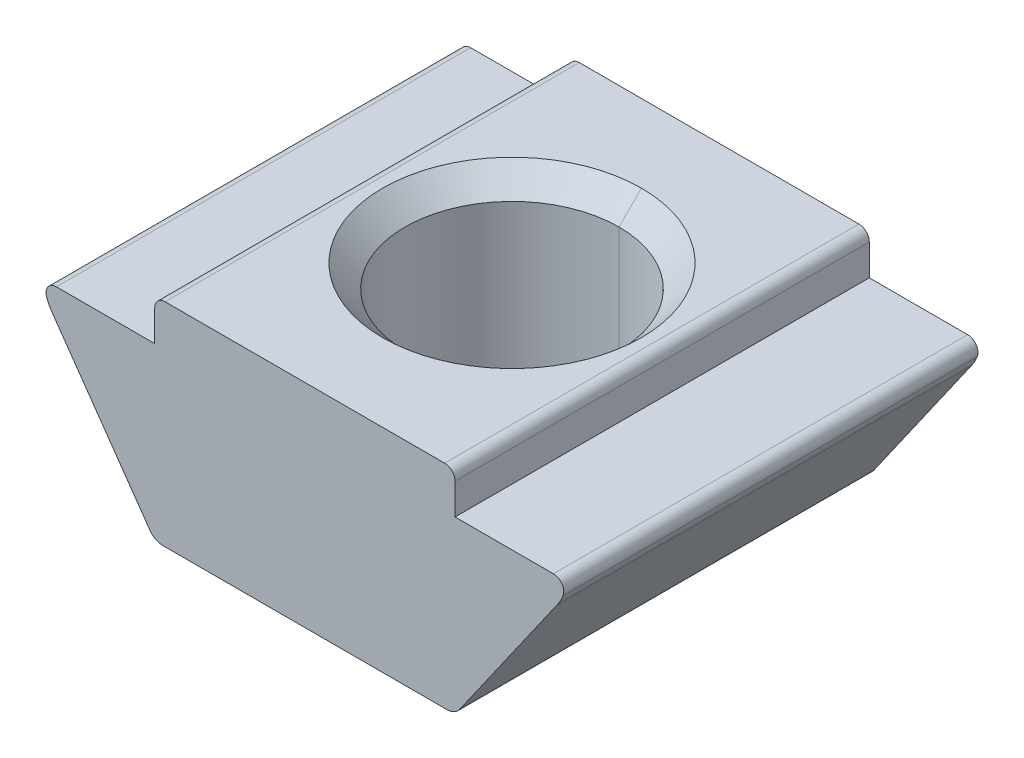
ISO-10303-21;
HEADER;
FILE_DESCRIPTION(('STEP AP214'),'2;1');
FILE_NAME('part.step','',(''),(''),'','','');
FILE_SCHEMA(('AUTOMOTIVE_DESIGN { 1 0 10303 214 1 1 1 1 }'));
ENDSEC;
DATA;
#1=APPLICATION_CONTEXT('core data for automotive mechanical design processes');
#2=APPLICATION_PROTOCOL_DEFINITION('international standard','automotive_design',2000,#1);
#3=PRODUCT_CONTEXT('',#1,'mechanical');
#4=PRODUCT('Part','Part','',(#3));
#5=PRODUCT_RELATED_PRODUCT_CATEGORY('part','',(#4));
#6=PRODUCT_DEFINITION_FORMATION('','',#4);
#7=PRODUCT_DEFINITION_CONTEXT('part definition',#1,'design');
#8=PRODUCT_DEFINITION('design','',#6,#7);
#9=PRODUCT_DEFINITION_SHAPE('','',#8);
#10=(LENGTH_UNIT() NAMED_UNIT(*) SI_UNIT(.MILLI.,.METRE.));
#11=(NAMED_UNIT(*) PLANE_ANGLE_UNIT() SI_UNIT($,.RADIAN.));
#12=(NAMED_UNIT(*) SI_UNIT($,.STERADIAN.) SOLID_ANGLE_UNIT());
#13=UNCERTAINTY_MEASURE_WITH_UNIT(LENGTH_MEASURE(1.E-05),#10,'distance_accuracy_value','');
#14=(GEOMETRIC_REPRESENTATION_CONTEXT(3) GLOBAL_UNCERTAINTY_ASSIGNED_CONTEXT((#13)) GLOBAL_UNIT_ASSIGNED_CONTEXT((#10,
#11,#12)) REPRESENTATION_CONTEXT('',''));
#15=CARTESIAN_POINT('',(0.,0.,0.));
#16=DIRECTION('',(0.,0.,1.));
#17=DIRECTION('',(1.,0.,0.));
#18=AXIS2_PLACEMENT_3D('',#15,#16,#17);
#19=CARTESIAN_POINT('',(-2.9,3.3,8.));
#20=DIRECTION('',(0.,-1.,0.));
#21=DIRECTION('',(0.,0.,-1.));
#22=AXIS2_PLACEMENT_3D('',#19,#20,#21);
#23=PLANE('',#22);
#24=DIRECTION('',(-1.,0.,0.));
#25=VECTOR('',#24,1.);
#26=CARTESIAN_POINT('',(-2.9,3.3,0.));
#27=LINE('',#26,#25);
#28=CARTESIAN_POINT('',(-2.9,3.3,0.));
#29=VERTEX_POINT('',#28);
#30=CARTESIAN_POINT('',(-4.7998662157511,3.3,0.));
#31=VERTEX_POINT('',#30);
#32=EDGE_CURVE('E11',#29,#31,#27,.T.);
#33=ORIENTED_EDGE('',*,*,#32,.T.);
#34=DIRECTION('',(0.,0.,-1.));
#35=VECTOR('',#34,1.);
#36=CARTESIAN_POINT('',(-4.7998662157511,3.3,8.));
#37=LINE('',#36,#35);
#38=CARTESIAN_POINT('',(-4.7998662157511,3.3,8.));
#39=VERTEX_POINT('',#38);
#40=EDGE_CURVE('E25',#39,#31,#37,.T.);
#41=ORIENTED_EDGE('',*,*,#40,.F.);
#42=DIRECTION('',(-1.,0.,0.));
#43=VECTOR('',#42,1.);
#44=CARTESIAN_POINT('',(-2.9,3.3,8.));
#45=LINE('',#44,#43);
#46=CARTESIAN_POINT('',(-2.9,3.3,8.));
#47=VERTEX_POINT('',#46);
#48=EDGE_CURVE('E407',#47,#39,#45,.T.);
#49=ORIENTED_EDGE('',*,*,#48,.F.);
#50=DIRECTION('',(0.,0.,-1.));
#51=VECTOR('',#50,1.);
#52=CARTESIAN_POINT('',(-2.9,3.3,8.));
#53=LINE('',#52,#51);
#54=EDGE_CURVE('E403',#47,#29,#53,.T.);
#55=ORIENTED_EDGE('',*,*,#54,.T.);
#56=EDGE_LOOP('',(#33,#41,#49,#55));
#57=FACE_BOUND('',#56,.T.);
#58=ADVANCED_FACE('F17',(#57),#23,.F.);
#59=CARTESIAN_POINT('',(-2.9,3.9,8.));
#60=DIRECTION('',(1.,0.,0.));
#61=DIRECTION('',(0.,0.,-1.));
#62=AXIS2_PLACEMENT_3D('',#59,#60,#61);
#63=PLANE('',#62);
#64=DIRECTION('',(0.,-1.,0.));
#65=VECTOR('',#64,1.);
#66=CARTESIAN_POINT('',(-2.9,3.9,0.));
#67=LINE('',#66,#65);
#68=CARTESIAN_POINT('',(-2.9,3.9,0.));
#69=VERTEX_POINT('',#68);
#70=EDGE_CURVE('E398',#69,#29,#67,.T.);
#71=ORIENTED_EDGE('',*,*,#70,.T.);
#72=ORIENTED_EDGE('',*,*,#54,.F.);
#73=DIRECTION('',(0.,-1.,0.));
#74=VECTOR('',#73,1.);
#75=CARTESIAN_POINT('',(-2.9,3.9,8.));
#76=LINE('',#75,#74);
#77=CARTESIAN_POINT('',(-2.9,3.9,8.));
#78=VERTEX_POINT('',#77);
#79=EDGE_CURVE('E393',#78,#47,#76,.T.);
#80=ORIENTED_EDGE('',*,*,#79,.F.);
#81=DIRECTION('',(0.,0.,-1.));
#82=VECTOR('',#81,1.);
#83=CARTESIAN_POINT('',(-2.9,3.9,8.));
#84=LINE('',#83,#82);
#85=EDGE_CURVE('E389',#78,#69,#84,.T.);
#86=ORIENTED_EDGE('',*,*,#85,.T.);
#87=EDGE_LOOP('',(#71,#72,#80,#86));
#88=FACE_BOUND('',#87,.T.);
#89=ADVANCED_FACE('F424',(#88),#63,.F.);
#90=CARTESIAN_POINT('',(-2.7,3.9,8.));
#91=DIRECTION('',(0.,0.,-1.));
#92=DIRECTION('',(0.707106781186548,-0.707106781186547,0.));
#93=AXIS2_PLACEMENT_3D('',#90,#91,#92);
#94=CYLINDRICAL_SURFACE('',#93,0.20000000000003);
#95=CARTESIAN_POINT('',(-2.7,3.9,0.));
#96=DIRECTION('',(0.,0.,1.));
#97=DIRECTION('',(1.,0.,0.));
#98=AXIS2_PLACEMENT_3D('',#95,#96,#97);
#99=CIRCLE('',#98,0.20000000000003);
#100=CARTESIAN_POINT('',(-2.7,4.1,0.));
#101=VERTEX_POINT('',#100);
#102=EDGE_CURVE('E384',#101,#69,#99,.T.);
#103=ORIENTED_EDGE('',*,*,#102,.T.);
#104=ORIENTED_EDGE('',*,*,#85,.F.);
#105=CARTESIAN_POINT('',(-2.7,3.9,8.));
#106=DIRECTION('',(0.,0.,1.));
#107=DIRECTION('',(1.,0.,0.));
#108=AXIS2_PLACEMENT_3D('',#105,#106,#107);
#109=CIRCLE('',#108,0.20000000000003);
#110=CARTESIAN_POINT('',(-2.7,4.1,8.));
#111=VERTEX_POINT('',#110);
#112=EDGE_CURVE('E379',#111,#78,#109,.T.);
#113=ORIENTED_EDGE('',*,*,#112,.F.);
#114=DIRECTION('',(0.,0.,-1.));
#115=VECTOR('',#114,1.);
#116=CARTESIAN_POINT('',(-2.7,4.1,8.));
#117=LINE('',#116,#115);
#118=EDGE_CURVE('E375',#111,#101,#117,.T.);
#119=ORIENTED_EDGE('',*,*,#118,.T.);
#120=EDGE_LOOP('',(#103,#104,#113,#119));
#121=FACE_BOUND('',#120,.T.);
#122=ADVANCED_FACE('F478',(#121),#94,.T.);
#123=CARTESIAN_POINT('',(2.7,4.1,8.));
#124=DIRECTION('',(0.,-1.,0.));
#125=DIRECTION('',(0.,0.,-1.));
#126=AXIS2_PLACEMENT_3D('',#123,#124,#125);
#127=PLANE('',#126);
#128=CARTESIAN_POINT('',(0.,4.1,4.));
#129=DIRECTION('',(0.,1.,0.));
#130=DIRECTION('',(0.,0.,1.));
#131=AXIS2_PLACEMENT_3D('',#128,#129,#130);
#132=CIRCLE('',#131,2.5);
#133=CARTESIAN_POINT('',(0.,4.1,1.5));
#134=VERTEX_POINT('',#133);
#135=CARTESIAN_POINT('',(0.,4.1,6.5));
#136=VERTEX_POINT('',#135);
#137=EDGE_CURVE('E161',#134,#136,#132,.T.);
#138=ORIENTED_EDGE('',*,*,#137,.F.);
#139=CARTESIAN_POINT('',(0.,4.1,4.));
#140=DIRECTION('',(0.,1.,0.));
#141=DIRECTION('',(0.,0.,1.));
#142=AXIS2_PLACEMENT_3D('',#139,#140,#141);
#143=CIRCLE('',#142,2.5);
#144=EDGE_CURVE('E368',#136,#134,#143,.T.);
#145=ORIENTED_EDGE('',*,*,#144,.F.);
#146=EDGE_LOOP('',(#138,#145));
#147=FACE_BOUND('',#146,.T.);
#148=DIRECTION('',(-1.,0.,0.));
#149=VECTOR('',#148,1.);
#150=CARTESIAN_POINT('',(2.7,4.1,0.));
#151=LINE('',#150,#149);
#152=CARTESIAN_POINT('',(2.7,4.1,0.));
#153=VERTEX_POINT('',#152);
#154=EDGE_CURVE('E363',#153,#101,#151,.T.);
#155=ORIENTED_EDGE('',*,*,#154,.T.);
#156=ORIENTED_EDGE('',*,*,#118,.F.);
#157=DIRECTION('',(-1.,0.,0.));
#158=VECTOR('',#157,1.);
#159=CARTESIAN_POINT('',(2.7,4.1,8.));
#160=LINE('',#159,#158);
#161=CARTESIAN_POINT('',(2.7,4.1,8.));
#162=VERTEX_POINT('',#161);
#163=EDGE_CURVE('E358',#162,#111,#160,.T.);
#164=ORIENTED_EDGE('',*,*,#163,.F.);
#165=DIRECTION('',(0.,0.,-1.));
#166=VECTOR('',#165,1.);
#167=CARTESIAN_POINT('',(2.7,4.1,8.));
#168=LINE('',#167,#166);
#169=EDGE_CURVE('E354',#162,#153,#168,.T.);
#170=ORIENTED_EDGE('',*,*,#169,.T.);
#171=EDGE_LOOP('',(#155,#156,#164,#170));
#172=FACE_BOUND('',#171,.T.);
#173=ADVANCED_FACE('F475',(#147,#172),#127,.F.);
#174=CARTESIAN_POINT('',(2.7,3.9,8.));
#175=DIRECTION('',(0.,0.,-1.));
#176=DIRECTION('',(-0.707106781186548,-0.707106781186547,0.));
#177=AXIS2_PLACEMENT_3D('',#174,#175,#176);
#178=CYLINDRICAL_SURFACE('',#177,0.200000000000031);
#179=CARTESIAN_POINT('',(2.7,3.9,0.));
#180=DIRECTION('',(0.,0.,1.));
#181=DIRECTION('',(1.,0.,0.));
#182=AXIS2_PLACEMENT_3D('',#179,#180,#181);
#183=CIRCLE('',#182,0.200000000000031);
#184=CARTESIAN_POINT('',(2.9,3.9,0.));
#185=VERTEX_POINT('',#184);
#186=EDGE_CURVE('E349',#185,#153,#183,.T.);
#187=ORIENTED_EDGE('',*,*,#186,.T.);
#188=ORIENTED_EDGE('',*,*,#169,.F.);
#189=CARTESIAN_POINT('',(2.7,3.9,8.));
#190=DIRECTION('',(0.,0.,1.));
#191=DIRECTION('',(1.,0.,0.));
#192=AXIS2_PLACEMENT_3D('',#189,#190,#191);
#193=CIRCLE('',#192,0.200000000000031);
#194=CARTESIAN_POINT('',(2.9,3.9,8.));
#195=VERTEX_POINT('',#194);
#196=EDGE_CURVE('E344',#195,#162,#193,.T.);
#197=ORIENTED_EDGE('',*,*,#196,.F.);
#198=DIRECTION('',(0.,0.,-1.));
#199=VECTOR('',#198,1.);
#200=CARTESIAN_POINT('',(2.9,3.9,8.));
#201=LINE('',#200,#199);
#202=EDGE_CURVE('E340',#195,#185,#201,.T.);
#203=ORIENTED_EDGE('',*,*,#202,.T.);
#204=EDGE_LOOP('',(#187,#188,#197,#203));
#205=FACE_BOUND('',#204,.T.);
#206=ADVANCED_FACE('F472',(#205),#178,.T.);
#207=CARTESIAN_POINT('',(2.9,3.3,8.));
#208=DIRECTION('',(-1.,0.,0.));
#209=DIRECTION('',(0.,0.,1.));
#210=AXIS2_PLACEMENT_3D('',#207,#208,#209);
#211=PLANE('',#210);
#212=DIRECTION('',(0.,1.,0.));
#213=VECTOR('',#212,1.);
#214=CARTESIAN_POINT('',(2.9,3.3,0.));
#215=LINE('',#214,#213);
#216=CARTESIAN_POINT('',(2.9,3.3,0.));
#217=VERTEX_POINT('',#216);
#218=EDGE_CURVE('E335',#217,#185,#215,.T.);
#219=ORIENTED_EDGE('',*,*,#218,.T.);
#220=ORIENTED_EDGE('',*,*,#202,.F.);
#221=DIRECTION('',(0.,1.,0.));
#222=VECTOR('',#221,1.);
#223=CARTESIAN_POINT('',(2.9,3.3,8.));
#224=LINE('',#223,#222);
#225=CARTESIAN_POINT('',(2.9,3.3,8.));
#226=VERTEX_POINT('',#225);
#227=EDGE_CURVE('E330',#226,#195,#224,.T.);
#228=ORIENTED_EDGE('',*,*,#227,.F.);
#229=DIRECTION('',(0.,0.,-1.));
#230=VECTOR('',#229,1.);
#231=CARTESIAN_POINT('',(2.9,3.3,8.));
#232=LINE('',#231,#230);
#233=EDGE_CURVE('E326',#226,#217,#232,.T.);
#234=ORIENTED_EDGE('',*,*,#233,.T.);
#235=EDGE_LOOP('',(#219,#220,#228,#234));
#236=FACE_BOUND('',#235,.T.);
#237=ADVANCED_FACE('F467',(#236),#211,.F.);
#238=CARTESIAN_POINT('',(4.7998662157511,3.3,8.));
#239=DIRECTION('',(0.,-1.,0.));
#240=DIRECTION('',(0.,0.,-1.));
#241=AXIS2_PLACEMENT_3D('',#238,#239,#240);
#242=PLANE('',#241);
#243=DIRECTION('',(-1.,0.,0.));
#244=VECTOR('',#243,1.);
#245=CARTESIAN_POINT('',(4.7998662157511,3.3,0.));
#246=LINE('',#245,#244);
#247=CARTESIAN_POINT('',(4.7998662157511,3.3,0.));
#248=VERTEX_POINT('',#247);
#249=EDGE_CURVE('E321',#248,#217,#246,.T.);
#250=ORIENTED_EDGE('',*,*,#249,.T.);
#251=ORIENTED_EDGE('',*,*,#233,.F.);
#252=DIRECTION('',(-1.,0.,0.));
#253=VECTOR('',#252,1.);
#254=CARTESIAN_POINT('',(4.7998662157511,3.3,8.));
#255=LINE('',#254,#253);
#256=CARTESIAN_POINT('',(4.7998662157511,3.3,8.));
#257=VERTEX_POINT('',#256);
#258=EDGE_CURVE('E316',#257,#226,#255,.T.);
#259=ORIENTED_EDGE('',*,*,#258,.F.);
#260=DIRECTION('',(0.,0.,-1.));
#261=VECTOR('',#260,1.);
#262=CARTESIAN_POINT('',(4.7998662157511,3.3,8.));
#263=LINE('',#262,#261);
#264=EDGE_CURVE('E312',#257,#248,#263,.T.);
#265=ORIENTED_EDGE('',*,*,#264,.T.);
#266=EDGE_LOOP('',(#250,#251,#259,#265));
#267=FACE_BOUND('',#266,.T.);
#268=ADVANCED_FACE('F463',(#267),#242,.F.);
#269=CARTESIAN_POINT('',(4.7998662157511,3.10000000000006,8.));
#270=DIRECTION('',(0.,0.,-1.));
#271=DIRECTION('',(-0.827037597866269,-0.562146610516858,0.));
#272=AXIS2_PLACEMENT_3D('',#269,#270,#271);
#273=CYLINDRICAL_SURFACE('',#272,0.199999999999944);
#274=CARTESIAN_POINT('',(4.7998662157511,3.10000000000006,0.));
#275=DIRECTION('',(0.,0.,1.));
#276=DIRECTION('',(1.,0.,0.));
#277=AXIS2_PLACEMENT_3D('',#274,#275,#276);
#278=CIRCLE('',#277,0.199999999999944);
#279=CARTESIAN_POINT('',(4.9858327696888,3.0264035271463,0.));
#280=VERTEX_POINT('',#279);
#281=EDGE_CURVE('E307',#280,#248,#278,.T.);
#282=ORIENTED_EDGE('',*,*,#281,.T.);
#283=ORIENTED_EDGE('',*,*,#264,.F.);
#284=CARTESIAN_POINT('',(4.7998662157511,3.10000000000006,8.));
#285=DIRECTION('',(0.,0.,1.));
#286=DIRECTION('',(1.,0.,0.));
#287=AXIS2_PLACEMENT_3D('',#284,#285,#286);
#288=CIRCLE('',#287,0.199999999999944);
#289=CARTESIAN_POINT('',(4.9858327696888,3.0264035271463,8.));
#290=VERTEX_POINT('',#289);
#291=EDGE_CURVE('E302',#290,#257,#288,.T.);
#292=ORIENTED_EDGE('',*,*,#291,.F.);
#293=DIRECTION('',(0.,0.,-1.));
#294=VECTOR('',#293,1.);
#295=CARTESIAN_POINT('',(4.9858327696888,3.0264035271463,8.));
#296=LINE('',#295,#294);
#297=EDGE_CURVE('E298',#290,#280,#296,.T.);
#298=ORIENTED_EDGE('',*,*,#297,.T.);
#299=EDGE_LOOP('',(#282,#283,#292,#298));
#300=FACE_BOUND('',#299,.T.);
#301=ADVANCED_FACE('F460',(#300),#273,.T.);
#302=CARTESIAN_POINT('',(4.05600000000028,3.39438589141449,8.));
#303=DIRECTION('',(0.,0.,-1.));
#304=DIRECTION('',(-0.880513596901839,0.474020891597602,0.));
#305=AXIS2_PLACEMENT_3D('',#302,#303,#304);
#306=CYLINDRICAL_SURFACE('',#305,0.999999999999519);
#307=CARTESIAN_POINT('',(4.05600000000028,3.39438589141449,0.));
#308=DIRECTION('',(0.,0.,1.));
#309=DIRECTION('',(1.,0.,0.));
#310=AXIS2_PLACEMENT_3D('',#307,#308,#309);
#311=CIRCLE('',#310,0.999999999999519);
#312=CARTESIAN_POINT('',(4.875152044289,2.8208094550639,0.));
#313=VERTEX_POINT('',#312);
#314=EDGE_CURVE('E293',#313,#280,#311,.T.);
#315=ORIENTED_EDGE('',*,*,#314,.T.);
#316=ORIENTED_EDGE('',*,*,#297,.F.);
#317=CARTESIAN_POINT('',(4.05600000000028,3.39438589141449,8.));
#318=DIRECTION('',(0.,0.,1.));
#319=DIRECTION('',(1.,0.,0.));
#320=AXIS2_PLACEMENT_3D('',#317,#318,#319);
#321=CIRCLE('',#320,0.999999999999519);
#322=CARTESIAN_POINT('',(4.875152044289,2.8208094550639,8.));
#323=VERTEX_POINT('',#322);
#324=EDGE_CURVE('E288',#323,#290,#321,.T.);
#325=ORIENTED_EDGE('',*,*,#324,.F.);
#326=DIRECTION('',(0.,0.,-1.));
#327=VECTOR('',#326,1.);
#328=CARTESIAN_POINT('',(4.875152044289,2.8208094550639,8.));
#329=LINE('',#328,#327);
#330=EDGE_CURVE('E284',#323,#313,#329,.T.);
#331=ORIENTED_EDGE('',*,*,#330,.T.);
#332=EDGE_LOOP('',(#315,#316,#325,#331));
#333=FACE_BOUND('',#332,.T.);
#334=ADVANCED_FACE('F455',(#333),#306,.T.);
#335=CARTESIAN_POINT('',(2.9895754981212,0.12792706909469,8.));
#336=DIRECTION('',(-0.819152044288991,0.573576436351048,0.));
#337=DIRECTION('',(-0.573576436351048,-0.819152044288991,0.));
#338=AXIS2_PLACEMENT_3D('',#335,#336,#337);
#339=PLANE('',#338);
#340=DIRECTION('',(0.573576436351048,0.81915204428899,0.));
#341=VECTOR('',#340,1.);
#342=CARTESIAN_POINT('',(2.9895754981212,0.12792706909469,0.));
#343=LINE('',#342,#341);
#344=CARTESIAN_POINT('',(2.9895754981212,0.12792706909469,0.));
#345=VERTEX_POINT('',#344);
#346=EDGE_CURVE('E279',#345,#313,#343,.T.);
#347=ORIENTED_EDGE('',*,*,#346,.T.);
#348=ORIENTED_EDGE('',*,*,#330,.F.);
#349=DIRECTION('',(0.573576436351048,0.81915204428899,0.));
#350=VECTOR('',#349,1.);
#351=CARTESIAN_POINT('',(2.9895754981212,0.12792706909469,8.));
#352=LINE('',#351,#350);
#353=CARTESIAN_POINT('',(2.9895754981212,0.12792706909469,8.));
#354=VERTEX_POINT('',#353);
#355=EDGE_CURVE('E274',#354,#323,#352,.T.);
#356=ORIENTED_EDGE('',*,*,#355,.F.);
#357=DIRECTION('',(0.,0.,-1.));
#358=VECTOR('',#357,1.);
#359=CARTESIAN_POINT('',(2.9895754981212,0.12792706909469,8.));
#360=LINE('',#359,#358);
#361=EDGE_CURVE('E270',#354,#345,#360,.T.);
#362=ORIENTED_EDGE('',*,*,#361,.T.);
#363=EDGE_LOOP('',(#347,#348,#356,#362));
#364=FACE_BOUND('',#363,.T.);
#365=ADVANCED_FACE('F452',(#364),#339,.F.);
#366=CARTESIAN_POINT('',(2.74382988483448,0.300000000000038,8.));
#367=DIRECTION('',(0.,0.,-1.));
#368=DIRECTION('',(-0.461748613235041,0.887010833178218,0.));
#369=AXIS2_PLACEMENT_3D('',#366,#367,#368);
#370=CYLINDRICAL_SURFACE('',#369,0.300000000000038);
#371=CARTESIAN_POINT('',(2.74382988483448,0.300000000000038,0.));
#372=DIRECTION('',(0.,0.,1.));
#373=DIRECTION('',(1.,0.,0.));
#374=AXIS2_PLACEMENT_3D('',#371,#372,#373);
#375=CIRCLE('',#374,0.300000000000038);
#376=CARTESIAN_POINT('',(2.7438298848345,0.,0.));
#377=VERTEX_POINT('',#376);
#378=EDGE_CURVE('E265',#377,#345,#375,.T.);
#379=ORIENTED_EDGE('',*,*,#378,.T.);
#380=ORIENTED_EDGE('',*,*,#361,.F.);
#381=CARTESIAN_POINT('',(2.74382988483448,0.300000000000038,8.));
#382=DIRECTION('',(0.,0.,1.));
#383=DIRECTION('',(1.,0.,0.));
#384=AXIS2_PLACEMENT_3D('',#381,#382,#383);
#385=CIRCLE('',#384,0.300000000000038);
#386=CARTESIAN_POINT('',(2.7438298848345,0.,8.));
#387=VERTEX_POINT('',#386);
#388=EDGE_CURVE('E260',#387,#354,#385,.T.);
#389=ORIENTED_EDGE('',*,*,#388,.F.);
#390=DIRECTION('',(0.,0.,-1.));
#391=VECTOR('',#390,1.);
#392=CARTESIAN_POINT('',(2.7438298848345,0.,8.));
#393=LINE('',#392,#391);
#394=EDGE_CURVE('E256',#387,#377,#393,.T.);
#395=ORIENTED_EDGE('',*,*,#394,.T.);
#396=EDGE_LOOP('',(#379,#380,#389,#395));
#397=FACE_BOUND('',#396,.T.);
#398=ADVANCED_FACE('F449',(#397),#370,.T.);
#399=CARTESIAN_POINT('',(-2.7438298848345,0.,8.));
#400=DIRECTION('',(0.,1.,0.));
#401=DIRECTION('',(0.,0.,1.));
#402=AXIS2_PLACEMENT_3D('',#399,#400,#401);
#403=PLANE('',#402);
#404=CARTESIAN_POINT('',(0.,0.,4.));
#405=DIRECTION('',(0.,1.,0.));
#406=DIRECTION('',(0.,0.,1.));
#407=AXIS2_PLACEMENT_3D('',#404,#405,#406);
#408=CIRCLE('',#407,2.067);
#409=CARTESIAN_POINT('',(0.,0.,6.067));
#410=VERTEX_POINT('',#409);
#411=CARTESIAN_POINT('',(0.,0.,1.933));
#412=VERTEX_POINT('',#411);
#413=EDGE_CURVE('E173',#410,#412,#408,.T.);
#414=ORIENTED_EDGE('',*,*,#413,.T.);
#415=CARTESIAN_POINT('',(0.,0.,4.));
#416=DIRECTION('',(0.,1.,0.));
#417=DIRECTION('',(0.,0.,1.));
#418=AXIS2_PLACEMENT_3D('',#415,#416,#417);
#419=CIRCLE('',#418,2.067);
#420=EDGE_CURVE('E249',#412,#410,#419,.T.);
#421=ORIENTED_EDGE('',*,*,#420,.T.);
#422=EDGE_LOOP('',(#414,#421));
#423=FACE_BOUND('',#422,.T.);
#424=DIRECTION('',(1.,0.,0.));
#425=VECTOR('',#424,1.);
#426=CARTESIAN_POINT('',(-2.7438298848345,0.,0.));
#427=LINE('',#426,#425);
#428=CARTESIAN_POINT('',(-2.7438298848345,0.,0.));
#429=VERTEX_POINT('',#428);
#430=EDGE_CURVE('E244',#429,#377,#427,.T.);
#431=ORIENTED_EDGE('',*,*,#430,.T.);
#432=ORIENTED_EDGE('',*,*,#394,.F.);
#433=DIRECTION('',(1.,0.,0.));
#434=VECTOR('',#433,1.);
#435=CARTESIAN_POINT('',(-2.7438298848345,0.,8.));
#436=LINE('',#435,#434);
#437=CARTESIAN_POINT('',(-2.7438298848345,0.,8.));
#438=VERTEX_POINT('',#437);
#439=EDGE_CURVE('E239',#438,#387,#436,.T.);
#440=ORIENTED_EDGE('',*,*,#439,.F.);
#441=DIRECTION('',(0.,0.,-1.));
#442=VECTOR('',#441,1.);
#443=CARTESIAN_POINT('',(-2.7438298848345,0.,8.));
#444=LINE('',#443,#442);
#445=EDGE_CURVE('E235',#438,#429,#444,.T.);
#446=ORIENTED_EDGE('',*,*,#445,.T.);
#447=EDGE_LOOP('',(#431,#432,#440,#446));
#448=FACE_BOUND('',#447,.T.);
#449=ADVANCED_FACE('F443',(#423,#448),#403,.F.);
#450=CARTESIAN_POINT('',(-2.74382988483449,0.300000000000032,8.));
#451=DIRECTION('',(0.,0.,-1.));
#452=DIRECTION('',(0.461748613235037,0.88701083317822,0.));
#453=AXIS2_PLACEMENT_3D('',#450,#451,#452);
#454=CYLINDRICAL_SURFACE('',#453,0.300000000000032);
#455=CARTESIAN_POINT('',(-2.74382988483449,0.300000000000032,0.));
#456=DIRECTION('',(0.,0.,1.));
#457=DIRECTION('',(1.,0.,0.));
#458=AXIS2_PLACEMENT_3D('',#455,#456,#457);
#459=CIRCLE('',#458,0.300000000000032);
#460=CARTESIAN_POINT('',(-2.9895754981212,0.12792706909469,0.));
#461=VERTEX_POINT('',#460);
#462=EDGE_CURVE('E230',#461,#429,#459,.T.);
#463=ORIENTED_EDGE('',*,*,#462,.T.);
#464=ORIENTED_EDGE('',*,*,#445,.F.);
#465=CARTESIAN_POINT('',(-2.74382988483449,0.300000000000032,8.));
#466=DIRECTION('',(0.,0.,1.));
#467=DIRECTION('',(1.,0.,0.));
#468=AXIS2_PLACEMENT_3D('',#465,#466,#467);
#469=CIRCLE('',#468,0.300000000000032);
#470=CARTESIAN_POINT('',(-2.9895754981212,0.12792706909469,8.));
#471=VERTEX_POINT('',#470);
#472=EDGE_CURVE('E225',#471,#438,#469,.T.);
#473=ORIENTED_EDGE('',*,*,#472,.F.);
#474=DIRECTION('',(0.,0.,-1.));
#475=VECTOR('',#474,1.);
#476=CARTESIAN_POINT('',(-2.9895754981212,0.12792706909469,8.));
#477=LINE('',#476,#475);
#478=EDGE_CURVE('E221',#471,#461,#477,.T.);
#479=ORIENTED_EDGE('',*,*,#478,.T.);
#480=EDGE_LOOP('',(#463,#464,#473,#479));
#481=FACE_BOUND('',#480,.T.);
#482=ADVANCED_FACE('F440',(#481),#454,.T.);
#483=CARTESIAN_POINT('',(-4.875152044289,2.8208094550639,8.));
#484=DIRECTION('',(0.819152044288991,0.573576436351048,0.));
#485=DIRECTION('',(-0.573576436351048,0.819152044288991,0.));
#486=AXIS2_PLACEMENT_3D('',#483,#484,#485);
#487=PLANE('',#486);
#488=DIRECTION('',(0.573576436351048,-0.81915204428899,0.));
#489=VECTOR('',#488,1.);
#490=CARTESIAN_POINT('',(-4.875152044289,2.8208094550639,0.));
#491=LINE('',#490,#489);
#492=CARTESIAN_POINT('',(-4.875152044289,2.8208094550639,0.));
#493=VERTEX_POINT('',#492);
#494=EDGE_CURVE('E216',#493,#461,#491,.T.);
#495=ORIENTED_EDGE('',*,*,#494,.T.);
#496=ORIENTED_EDGE('',*,*,#478,.F.);
#497=DIRECTION('',(0.573576436351048,-0.81915204428899,0.));
#498=VECTOR('',#497,1.);
#499=CARTESIAN_POINT('',(-4.875152044289,2.8208094550639,8.));
#500=LINE('',#499,#498);
#501=CARTESIAN_POINT('',(-4.875152044289,2.8208094550639,8.));
#502=VERTEX_POINT('',#501);
#503=EDGE_CURVE('E211',#502,#471,#500,.T.);
#504=ORIENTED_EDGE('',*,*,#503,.F.);
#505=DIRECTION('',(0.,0.,-1.));
#506=VECTOR('',#505,1.);
#507=CARTESIAN_POINT('',(-4.875152044289,2.8208094550639,8.));
#508=LINE('',#507,#506);
#509=EDGE_CURVE('E207',#502,#493,#508,.T.);
#510=ORIENTED_EDGE('',*,*,#509,.T.);
#511=EDGE_LOOP('',(#495,#496,#504,#510));
#512=FACE_BOUND('',#511,.T.);
#513=ADVANCED_FACE('F438',(#512),#487,.F.);
#514=CARTESIAN_POINT('',(-4.05600000000028,3.39438589141449,8.));
#515=DIRECTION('',(0.,0.,-1.));
#516=DIRECTION('',(0.880513596901123,0.474020891598932,0.));
#517=AXIS2_PLACEMENT_3D('',#514,#515,#516);
#518=CYLINDRICAL_SURFACE('',#517,0.999999999999519);
#519=CARTESIAN_POINT('',(-4.05600000000028,3.39438589141449,0.));
#520=DIRECTION('',(0.,0.,1.));
#521=DIRECTION('',(1.,0.,0.));
#522=AXIS2_PLACEMENT_3D('',#519,#520,#521);
#523=CIRCLE('',#522,0.999999999999519);
#524=CARTESIAN_POINT('',(-4.9858327696888,3.0264035271463,0.));
#525=VERTEX_POINT('',#524);
#526=EDGE_CURVE('E202',#525,#493,#523,.T.);
#527=ORIENTED_EDGE('',*,*,#526,.T.);
#528=ORIENTED_EDGE('',*,*,#509,.F.);
#529=CARTESIAN_POINT('',(-4.05600000000028,3.39438589141449,8.));
#530=DIRECTION('',(0.,0.,1.));
#531=DIRECTION('',(1.,0.,0.));
#532=AXIS2_PLACEMENT_3D('',#529,#530,#531);
#533=CIRCLE('',#532,0.999999999999519);
#534=CARTESIAN_POINT('',(-4.9858327696888,3.0264035271463,8.));
#535=VERTEX_POINT('',#534);
#536=EDGE_CURVE('E197',#535,#502,#533,.T.);
#537=ORIENTED_EDGE('',*,*,#536,.F.);
#538=DIRECTION('',(0.,0.,-1.));
#539=VECTOR('',#538,1.);
#540=CARTESIAN_POINT('',(-4.9858327696888,3.0264035271463,8.));
#541=LINE('',#540,#539);
#542=EDGE_CURVE('E193',#535,#525,#541,.T.);
#543=ORIENTED_EDGE('',*,*,#542,.T.);
#544=EDGE_LOOP('',(#527,#528,#537,#543));
#545=FACE_BOUND('',#544,.T.);
#546=ADVANCED_FACE('F434',(#545),#518,.T.);
#547=CARTESIAN_POINT('',(-4.7998662157511,3.10000000000006,8.));
#548=DIRECTION('',(0.,0.,-1.));
#549=DIRECTION('',(0.82703759786627,-0.562146610516857,0.));
#550=AXIS2_PLACEMENT_3D('',#547,#548,#549);
#551=CYLINDRICAL_SURFACE('',#550,0.199999999999944);
#552=CARTESIAN_POINT('',(-4.7998662157511,3.10000000000006,0.));
#553=DIRECTION('',(0.,0.,1.));
#554=DIRECTION('',(1.,0.,0.));
#555=AXIS2_PLACEMENT_3D('',#552,#553,#554);
#556=CIRCLE('',#555,0.199999999999944);
#557=EDGE_CURVE('E188',#31,#525,#556,.T.);
#558=ORIENTED_EDGE('',*,*,#557,.T.);
#559=ORIENTED_EDGE('',*,*,#542,.F.);
#560=CARTESIAN_POINT('',(-4.7998662157511,3.10000000000006,8.));
#561=DIRECTION('',(0.,0.,1.));
#562=DIRECTION('',(1.,0.,0.));
#563=AXIS2_PLACEMENT_3D('',#560,#561,#562);
#564=CIRCLE('',#563,0.199999999999944);
#565=EDGE_CURVE('E183',#39,#535,#564,.T.);
#566=ORIENTED_EDGE('',*,*,#565,.F.);
#567=ORIENTED_EDGE('',*,*,#40,.T.);
#568=EDGE_LOOP('',(#558,#559,#566,#567));
#569=FACE_BOUND('',#568,.T.);
#570=ADVANCED_FACE('F417',(#569),#551,.T.);
#571=CARTESIAN_POINT('',(-4.7998662157511,3.10000000000006,8.));
#572=DIRECTION('',(0.,0.,1.));
#573=DIRECTION('',(1.,0.,0.));
#574=AXIS2_PLACEMENT_3D('',#571,#572,#573);
#575=PLANE('',#574);
#576=ORIENTED_EDGE('',*,*,#48,.T.);
#577=ORIENTED_EDGE('',*,*,#565,.T.);
#578=ORIENTED_EDGE('',*,*,#536,.T.);
#579=ORIENTED_EDGE('',*,*,#503,.T.);
#580=ORIENTED_EDGE('',*,*,#472,.T.);
#581=ORIENTED_EDGE('',*,*,#439,.T.);
#582=ORIENTED_EDGE('',*,*,#388,.T.);
#583=ORIENTED_EDGE('',*,*,#355,.T.);
#584=ORIENTED_EDGE('',*,*,#324,.T.);
#585=ORIENTED_EDGE('',*,*,#291,.T.);
#586=ORIENTED_EDGE('',*,*,#258,.T.);
#587=ORIENTED_EDGE('',*,*,#227,.T.);
#588=ORIENTED_EDGE('',*,*,#196,.T.);
#589=ORIENTED_EDGE('',*,*,#163,.T.);
#590=ORIENTED_EDGE('',*,*,#112,.T.);
#591=ORIENTED_EDGE('',*,*,#79,.T.);
#592=EDGE_LOOP('',(#576,#577,#578,#579,#580,#581,#582,#583,#584,#585,#586,#587,#588,#589,#590,#591));
#593=FACE_BOUND('',#592,.T.);
#594=ADVANCED_FACE('F421',(#593),#575,.T.);
#595=CARTESIAN_POINT('',(-4.7998662157511,3.10000000000006,0.));
#596=DIRECTION('',(0.,0.,1.));
#597=DIRECTION('',(1.,0.,0.));
#598=AXIS2_PLACEMENT_3D('',#595,#596,#597);
#599=PLANE('',#598);
#600=ORIENTED_EDGE('',*,*,#32,.F.);
#601=ORIENTED_EDGE('',*,*,#70,.F.);
#602=ORIENTED_EDGE('',*,*,#102,.F.);
#603=ORIENTED_EDGE('',*,*,#154,.F.);
#604=ORIENTED_EDGE('',*,*,#186,.F.);
#605=ORIENTED_EDGE('',*,*,#218,.F.);
#606=ORIENTED_EDGE('',*,*,#249,.F.);
#607=ORIENTED_EDGE('',*,*,#281,.F.);
#608=ORIENTED_EDGE('',*,*,#314,.F.);
#609=ORIENTED_EDGE('',*,*,#346,.F.);
#610=ORIENTED_EDGE('',*,*,#378,.F.);
#611=ORIENTED_EDGE('',*,*,#430,.F.);
#612=ORIENTED_EDGE('',*,*,#462,.F.);
#613=ORIENTED_EDGE('',*,*,#494,.F.);
#614=ORIENTED_EDGE('',*,*,#526,.F.);
#615=ORIENTED_EDGE('',*,*,#557,.F.);
#616=EDGE_LOOP('',(#600,#601,#602,#603,#604,#605,#606,#607,#608,#609,#610,#611,#612,#613,#614,#615));
#617=FACE_BOUND('',#616,.T.);
#618=ADVANCED_FACE('F429',(#617),#599,.F.);
#619=CARTESIAN_POINT('',(0.,4.1,4.));
#620=DIRECTION('',(0.,1.,0.));
#621=DIRECTION('',(1.,0.,0.));
#622=AXIS2_PLACEMENT_3D('',#619,#620,#621);
#623=CYLINDRICAL_SURFACE('',#622,2.067);
#624=DIRECTION('',(0.,1.,0.));
#625=VECTOR('',#624,1.);
#626=CARTESIAN_POINT('',(0.,0.,1.933));
#627=LINE('',#626,#625);
#628=CARTESIAN_POINT('',(0.,3.667,1.933));
#629=VERTEX_POINT('',#628);
#630=EDGE_CURVE('E151',#412,#629,#627,.T.);
#631=ORIENTED_EDGE('',*,*,#630,.T.);
#632=CARTESIAN_POINT('',(0.,3.667,4.));
#633=DIRECTION('',(0.,1.,0.));
#634=DIRECTION('',(0.,0.,1.));
#635=AXIS2_PLACEMENT_3D('',#632,#633,#634);
#636=CIRCLE('',#635,2.067);
#637=CARTESIAN_POINT('',(0.,3.667,6.067));
#638=VERTEX_POINT('',#637);
#639=EDGE_CURVE('E144',#629,#638,#636,.T.);
#640=ORIENTED_EDGE('',*,*,#639,.T.);
#641=DIRECTION('',(0.,1.,0.));
#642=VECTOR('',#641,1.);
#643=CARTESIAN_POINT('',(0.,0.,6.067));
#644=LINE('',#643,#642);
#645=EDGE_CURVE('E149',#410,#638,#644,.T.);
#646=ORIENTED_EDGE('',*,*,#645,.F.);
#647=ORIENTED_EDGE('',*,*,#420,.F.);
#648=EDGE_LOOP('',(#631,#640,#646,#647));
#649=FACE_BOUND('',#648,.T.);
#650=ADVANCED_FACE('F146',(#649),#623,.F.);
#651=CARTESIAN_POINT('',(0.,4.1,4.));
#652=DIRECTION('',(0.,1.,0.));
#653=DIRECTION('',(-1.,0.,0.));
#654=AXIS2_PLACEMENT_3D('',#651,#652,#653);
#655=CYLINDRICAL_SURFACE('',#654,2.067);
#656=ORIENTED_EDGE('',*,*,#630,.F.);
#657=ORIENTED_EDGE('',*,*,#413,.F.);
#658=ORIENTED_EDGE('',*,*,#645,.T.);
#659=CARTESIAN_POINT('',(0.,3.667,4.));
#660=DIRECTION('',(0.,1.,0.));
#661=DIRECTION('',(0.,0.,1.));
#662=AXIS2_PLACEMENT_3D('',#659,#660,#661);
#663=CIRCLE('',#662,2.067);
#664=EDGE_CURVE('E167',#638,#629,#663,.T.);
#665=ORIENTED_EDGE('',*,*,#664,.T.);
#666=EDGE_LOOP('',(#656,#657,#658,#665));
#667=FACE_BOUND('',#666,.T.);
#668=ADVANCED_FACE('F172',(#667),#655,.F.);
#669=CARTESIAN_POINT('',(0.,3.667,4.));
#670=DIRECTION('',(0.,1.,0.));
#671=DIRECTION('',(-1.,0.,0.));
#672=AXIS2_PLACEMENT_3D('',#669,#670,#671);
#673=CONICAL_SURFACE('',#672,2.067,0.785398163397449);
#674=DIRECTION('',(0.,0.707106781186547,-0.707106781186548));
#675=VECTOR('',#674,1.);
#676=CARTESIAN_POINT('',(0.,3.667,1.933));
#677=LINE('',#676,#675);
#678=EDGE_CURVE('E164',#629,#134,#677,.T.);
#679=ORIENTED_EDGE('',*,*,#678,.F.);
#680=ORIENTED_EDGE('',*,*,#664,.F.);
#681=DIRECTION('',(0.,0.707106781186547,0.707106781186548));
#682=VECTOR('',#681,1.);
#683=CARTESIAN_POINT('',(0.,3.667,6.067));
#684=LINE('',#683,#682);
#685=EDGE_CURVE('E158',#638,#136,#684,.T.);
#686=ORIENTED_EDGE('',*,*,#685,.T.);
#687=ORIENTED_EDGE('',*,*,#144,.T.);
#688=EDGE_LOOP('',(#679,#680,#686,#687));
#689=FACE_BOUND('',#688,.T.);
#690=ADVANCED_FACE('F168',(#689),#673,.F.);
#691=CARTESIAN_POINT('',(0.,3.667,4.));
#692=DIRECTION('',(0.,1.,0.));
#693=DIRECTION('',(1.,0.,0.));
#694=AXIS2_PLACEMENT_3D('',#691,#692,#693);
#695=CONICAL_SURFACE('',#694,2.067,0.785398163397449);
#696=ORIENTED_EDGE('',*,*,#678,.T.);
#697=ORIENTED_EDGE('',*,*,#137,.T.);
#698=ORIENTED_EDGE('',*,*,#685,.F.);
#699=ORIENTED_EDGE('',*,*,#639,.F.);
#700=EDGE_LOOP('',(#696,#697,#698,#699));
#701=FACE_BOUND('',#700,.T.);
#702=ADVANCED_FACE('F160',(#701),#695,.F.);
#703=CLOSED_SHELL('',(#58,#89,#122,#173,#206,#237,#268,#301,#334,#365,#398,#449,#482,#513,#546,
#570,#594,#618,#650,#668,#690,#702));
#704=MANIFOLD_SOLID_BREP('B1',#703);
#705=ADVANCED_BREP_SHAPE_REPRESENTATION('',(#18,#704),#14);
#706=SHAPE_DEFINITION_REPRESENTATION(#9,#705);
ENDSEC;
END-ISO-10303-21;
